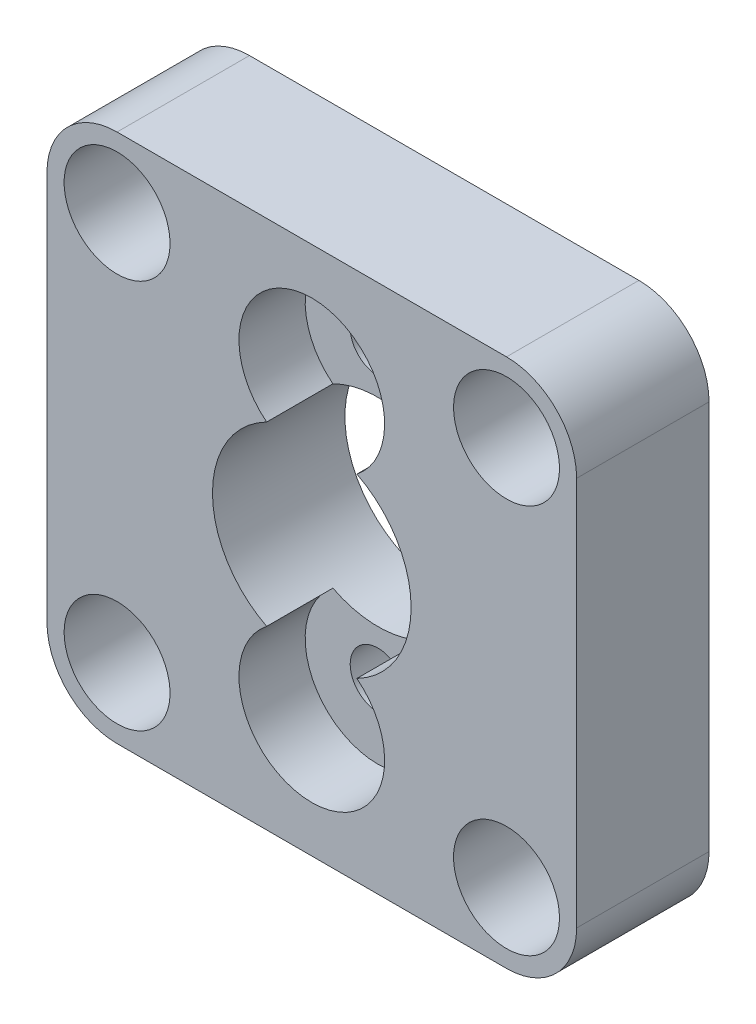
ISO-10303-21;
HEADER;
FILE_DESCRIPTION(('STEP AP214'),'2;1');
FILE_NAME('part.step','',(''),(''),'','','');
FILE_SCHEMA(('AUTOMOTIVE_DESIGN { 1 0 10303 214 1 1 1 1 }'));
ENDSEC;
DATA;
#1=APPLICATION_CONTEXT('core data for automotive mechanical design processes');
#2=APPLICATION_PROTOCOL_DEFINITION('international standard','automotive_design',2000,#1);
#3=PRODUCT_CONTEXT('',#1,'mechanical');
#4=PRODUCT('Part','Part','',(#3));
#5=PRODUCT_RELATED_PRODUCT_CATEGORY('part','',(#4));
#6=PRODUCT_DEFINITION_FORMATION('','',#4);
#7=PRODUCT_DEFINITION_CONTEXT('part definition',#1,'design');
#8=PRODUCT_DEFINITION('design','',#6,#7);
#9=PRODUCT_DEFINITION_SHAPE('','',#8);
#10=(LENGTH_UNIT() NAMED_UNIT(*) SI_UNIT(.MILLI.,.METRE.));
#11=(NAMED_UNIT(*) PLANE_ANGLE_UNIT() SI_UNIT($,.RADIAN.));
#12=(NAMED_UNIT(*) SI_UNIT($,.STERADIAN.) SOLID_ANGLE_UNIT());
#13=UNCERTAINTY_MEASURE_WITH_UNIT(LENGTH_MEASURE(1.E-05),#10,'distance_accuracy_value','');
#14=(GEOMETRIC_REPRESENTATION_CONTEXT(3) GLOBAL_UNCERTAINTY_ASSIGNED_CONTEXT((#13)) GLOBAL_UNIT_ASSIGNED_CONTEXT((#10,
#11,#12)) REPRESENTATION_CONTEXT('',''));
#15=CARTESIAN_POINT('',(0.,0.,0.));
#16=DIRECTION('',(0.,0.,1.));
#17=DIRECTION('',(1.,0.,0.));
#18=AXIS2_PLACEMENT_3D('',#15,#16,#17);
#19=CARTESIAN_POINT('',(-7.35229073212245,7.35229073212245,0.));
#20=DIRECTION('',(0.,0.,1.));
#21=DIRECTION('',(1.,0.,0.));
#22=AXIS2_PLACEMENT_3D('',#19,#20,#21);
#23=CYLINDRICAL_SURFACE('',#22,1.15);
#24=CARTESIAN_POINT('',(-7.35229073212245,7.35229073212245,0.));
#25=DIRECTION('',(0.,0.,1.));
#26=DIRECTION('',(1.,0.,0.));
#27=AXIS2_PLACEMENT_3D('',#24,#25,#26);
#28=CIRCLE('',#27,1.15);
#29=CARTESIAN_POINT('',(-6.20229073212244,7.35229073212245,0.));
#30=VERTEX_POINT('',#29);
#31=EDGE_CURVE('E222',#30,#30,#28,.T.);
#32=ORIENTED_EDGE('',*,*,#31,.F.);
#33=EDGE_LOOP('',(#32));
#34=FACE_BOUND('',#33,.T.);
#35=CARTESIAN_POINT('',(-7.35229073212245,7.35229073212245,2.));
#36=DIRECTION('',(0.,0.,1.));
#37=DIRECTION('',(1.,0.,0.));
#38=AXIS2_PLACEMENT_3D('',#35,#36,#37);
#39=CIRCLE('',#38,1.15);
#40=CARTESIAN_POINT('',(-6.20229073212244,7.35229073212245,2.));
#41=VERTEX_POINT('',#40);
#42=EDGE_CURVE('E207',#41,#41,#39,.F.);
#43=ORIENTED_EDGE('',*,*,#42,.F.);
#44=EDGE_LOOP('',(#43));
#45=FACE_BOUND('',#44,.T.);
#46=ADVANCED_FACE('F39',(#34,#45),#23,.F.);
#47=CARTESIAN_POINT('',(7.35229073212245,-7.35229073212245,0.));
#48=DIRECTION('',(0.,0.,1.));
#49=DIRECTION('',(1.,0.,0.));
#50=AXIS2_PLACEMENT_3D('',#47,#48,#49);
#51=CYLINDRICAL_SURFACE('',#50,1.15);
#52=CARTESIAN_POINT('',(7.35229073212245,-7.35229073212245,0.));
#53=DIRECTION('',(0.,0.,1.));
#54=DIRECTION('',(1.,0.,0.));
#55=AXIS2_PLACEMENT_3D('',#52,#53,#54);
#56=CIRCLE('',#55,1.15);
#57=CARTESIAN_POINT('',(8.50229073212244,-7.35229073212245,0.));
#58=VERTEX_POINT('',#57);
#59=EDGE_CURVE('E213',#58,#58,#56,.T.);
#60=ORIENTED_EDGE('',*,*,#59,.F.);
#61=EDGE_LOOP('',(#60));
#62=FACE_BOUND('',#61,.T.);
#63=CARTESIAN_POINT('',(7.35229073212245,-7.35229073212245,2.));
#64=DIRECTION('',(0.,0.,1.));
#65=DIRECTION('',(1.,0.,0.));
#66=AXIS2_PLACEMENT_3D('',#63,#64,#65);
#67=CIRCLE('',#66,1.15);
#68=CARTESIAN_POINT('',(8.50229073212244,-7.35229073212245,2.));
#69=VERTEX_POINT('',#68);
#70=EDGE_CURVE('E201',#69,#69,#67,.F.);
#71=ORIENTED_EDGE('',*,*,#70,.F.);
#72=EDGE_LOOP('',(#71));
#73=FACE_BOUND('',#72,.T.);
#74=ADVANCED_FACE('F304',(#62,#73),#51,.F.);
#75=CARTESIAN_POINT('',(0.,7.5,0.));
#76=DIRECTION('',(0.,0.,1.));
#77=DIRECTION('',(1.,0.,0.));
#78=AXIS2_PLACEMENT_3D('',#75,#76,#77);
#79=PLANE('',#78);
#80=CARTESIAN_POINT('',(-7.35229073212245,-7.35229073212245,0.));
#81=DIRECTION('',(0.,0.,1.));
#82=DIRECTION('',(-1.,0.,0.));
#83=AXIS2_PLACEMENT_3D('',#80,#81,#82);
#84=CIRCLE('',#83,1.15);
#85=CARTESIAN_POINT('',(-8.50229073212244,-7.35229073212245,0.));
#86=VERTEX_POINT('',#85);
#87=EDGE_CURVE('E209',#86,#86,#84,.T.);
#88=ORIENTED_EDGE('',*,*,#87,.T.);
#89=EDGE_LOOP('',(#88));
#90=FACE_BOUND('',#89,.T.);
#91=ORIENTED_EDGE('',*,*,#59,.T.);
#92=EDGE_LOOP('',(#91));
#93=FACE_BOUND('',#92,.T.);
#94=CARTESIAN_POINT('',(7.35229073212245,7.35229073212245,0.));
#95=DIRECTION('',(0.,0.,1.));
#96=DIRECTION('',(-1.,0.,0.));
#97=AXIS2_PLACEMENT_3D('',#94,#95,#96);
#98=CIRCLE('',#97,1.15);
#99=CARTESIAN_POINT('',(6.20229073212244,7.35229073212245,0.));
#100=VERTEX_POINT('',#99);
#101=EDGE_CURVE('E218',#100,#100,#98,.T.);
#102=ORIENTED_EDGE('',*,*,#101,.T.);
#103=EDGE_LOOP('',(#102));
#104=FACE_BOUND('',#103,.T.);
#105=ORIENTED_EDGE('',*,*,#31,.T.);
#106=EDGE_LOOP('',(#105));
#107=FACE_BOUND('',#106,.T.);
#108=CARTESIAN_POINT('',(0.,5.5,0.));
#109=DIRECTION('',(0.,0.,1.));
#110=DIRECTION('',(1.,0.,0.));
#111=AXIS2_PLACEMENT_3D('',#108,#109,#110);
#112=CIRCLE('',#111,1.05);
#113=CARTESIAN_POINT('',(1.05,5.5,0.));
#114=VERTEX_POINT('',#113);
#115=EDGE_CURVE('E161',#114,#114,#112,.T.);
#116=ORIENTED_EDGE('',*,*,#115,.T.);
#117=EDGE_LOOP('',(#116));
#118=FACE_BOUND('',#117,.T.);
#119=CARTESIAN_POINT('',(0.,-5.5,0.));
#120=DIRECTION('',(0.,0.,1.));
#121=DIRECTION('',(-1.,0.,0.));
#122=AXIS2_PLACEMENT_3D('',#119,#120,#121);
#123=CIRCLE('',#122,1.05);
#124=CARTESIAN_POINT('',(-1.05,-5.5,0.));
#125=VERTEX_POINT('',#124);
#126=EDGE_CURVE('E165',#125,#125,#123,.T.);
#127=ORIENTED_EDGE('',*,*,#126,.T.);
#128=EDGE_LOOP('',(#127));
#129=FACE_BOUND('',#128,.T.);
#130=CARTESIAN_POINT('',(0.,0.,0.));
#131=DIRECTION('',(0.,0.,1.));
#132=DIRECTION('',(1.,0.,0.));
#133=AXIS2_PLACEMENT_3D('',#130,#131,#132);
#134=CIRCLE('',#133,3.75);
#135=CARTESIAN_POINT('',(3.75,0.,0.));
#136=VERTEX_POINT('',#135);
#137=EDGE_CURVE('E47',#136,#136,#134,.T.);
#138=ORIENTED_EDGE('',*,*,#137,.T.);
#139=EDGE_LOOP('',(#138));
#140=FACE_BOUND('',#139,.T.);
#141=DIRECTION('',(1.,0.,0.));
#142=VECTOR('',#141,1.);
#143=CARTESIAN_POINT('',(10.,-10.,0.));
#144=LINE('',#143,#142);
#145=CARTESIAN_POINT('',(-7.35229073212245,-10.,0.));
#146=VERTEX_POINT('',#145);
#147=CARTESIAN_POINT('',(7.35229073212244,-10.,0.));
#148=VERTEX_POINT('',#147);
#149=EDGE_CURVE('E172',#146,#148,#144,.T.);
#150=ORIENTED_EDGE('',*,*,#149,.F.);
#151=CARTESIAN_POINT('',(-7.35229073212245,-7.35229073212245,0.));
#152=DIRECTION('',(0.,0.,-1.));
#153=DIRECTION('',(1.,0.,0.));
#154=AXIS2_PLACEMENT_3D('',#151,#152,#153);
#155=CIRCLE('',#154,2.64770926787756);
#156=CARTESIAN_POINT('',(-10.,-7.35229073212245,0.));
#157=VERTEX_POINT('',#156);
#158=EDGE_CURVE('E249',#146,#157,#155,.T.);
#159=ORIENTED_EDGE('',*,*,#158,.T.);
#160=DIRECTION('',(0.,-1.,0.));
#161=VECTOR('',#160,1.);
#162=CARTESIAN_POINT('',(-10.,-10.,0.));
#163=LINE('',#162,#161);
#164=CARTESIAN_POINT('',(-10.,7.35229073212245,0.));
#165=VERTEX_POINT('',#164);
#166=EDGE_CURVE('E169',#165,#157,#163,.T.);
#167=ORIENTED_EDGE('',*,*,#166,.F.);
#168=CARTESIAN_POINT('',(-7.35229073212245,7.35229073212245,0.));
#169=DIRECTION('',(0.,0.,-1.));
#170=DIRECTION('',(-1.,0.,0.));
#171=AXIS2_PLACEMENT_3D('',#168,#169,#170);
#172=CIRCLE('',#171,2.64770926787756);
#173=CARTESIAN_POINT('',(-7.35229073212245,10.,0.));
#174=VERTEX_POINT('',#173);
#175=EDGE_CURVE('E255',#165,#174,#172,.T.);
#176=ORIENTED_EDGE('',*,*,#175,.T.);
#177=DIRECTION('',(-1.,0.,0.));
#178=VECTOR('',#177,1.);
#179=CARTESIAN_POINT('',(10.,10.,0.));
#180=LINE('',#179,#178);
#181=CARTESIAN_POINT('',(7.35229073212244,10.,0.));
#182=VERTEX_POINT('',#181);
#183=EDGE_CURVE('E179',#182,#174,#180,.T.);
#184=ORIENTED_EDGE('',*,*,#183,.F.);
#185=CARTESIAN_POINT('',(7.35229073212244,7.35229073212245,0.));
#186=DIRECTION('',(0.,0.,-1.));
#187=DIRECTION('',(1.,0.,0.));
#188=AXIS2_PLACEMENT_3D('',#185,#186,#187);
#189=CIRCLE('',#188,2.64770926787756);
#190=CARTESIAN_POINT('',(10.,7.35229073212245,0.));
#191=VERTEX_POINT('',#190);
#192=EDGE_CURVE('E228',#182,#191,#189,.T.);
#193=ORIENTED_EDGE('',*,*,#192,.T.);
#194=DIRECTION('',(0.,1.,0.));
#195=VECTOR('',#194,1.);
#196=CARTESIAN_POINT('',(10.,-10.,0.));
#197=LINE('',#196,#195);
#198=CARTESIAN_POINT('',(10.,-7.35229073212245,0.));
#199=VERTEX_POINT('',#198);
#200=EDGE_CURVE('E176',#199,#191,#197,.T.);
#201=ORIENTED_EDGE('',*,*,#200,.F.);
#202=CARTESIAN_POINT('',(7.35229073212244,-7.35229073212245,0.));
#203=DIRECTION('',(0.,0.,-1.));
#204=DIRECTION('',(-1.,0.,0.));
#205=AXIS2_PLACEMENT_3D('',#202,#203,#204);
#206=CIRCLE('',#205,2.64770926787756);
#207=EDGE_CURVE('E239',#199,#148,#206,.T.);
#208=ORIENTED_EDGE('',*,*,#207,.T.);
#209=EDGE_LOOP('',(#150,#159,#167,#176,#184,#193,#201,#208));
#210=FACE_BOUND('',#209,.T.);
#211=ADVANCED_FACE('F41',(#90,#93,#104,#107,#118,#129,#140,#210),#79,.F.);
#212=CARTESIAN_POINT('',(0.,2.,5.));
#213=DIRECTION('',(0.,0.,-1.));
#214=DIRECTION('',(-1.,0.,0.));
#215=AXIS2_PLACEMENT_3D('',#212,#213,#214);
#216=PLANE('',#215);
#217=CARTESIAN_POINT('',(-7.35229073212245,-7.35229073212244,5.));
#218=DIRECTION('',(0.,0.,1.));
#219=DIRECTION('',(-1.,0.,0.));
#220=AXIS2_PLACEMENT_3D('',#217,#218,#219);
#221=CIRCLE('',#220,2.);
#222=CARTESIAN_POINT('',(-9.35229073212245,-7.35229073212244,5.));
#223=VERTEX_POINT('',#222);
#224=EDGE_CURVE('E389',#223,#223,#221,.T.);
#225=ORIENTED_EDGE('',*,*,#224,.F.);
#226=EDGE_LOOP('',(#225));
#227=FACE_BOUND('',#226,.T.);
#228=CARTESIAN_POINT('',(7.35229073212243,-7.35229073212246,5.));
#229=DIRECTION('',(0.,0.,1.));
#230=DIRECTION('',(1.,0.,0.));
#231=AXIS2_PLACEMENT_3D('',#228,#229,#230);
#232=CIRCLE('',#231,2.);
#233=CARTESIAN_POINT('',(9.35229073212243,-7.35229073212246,5.));
#234=VERTEX_POINT('',#233);
#235=EDGE_CURVE('E395',#234,#234,#232,.T.);
#236=ORIENTED_EDGE('',*,*,#235,.F.);
#237=EDGE_LOOP('',(#236));
#238=FACE_BOUND('',#237,.T.);
#239=CARTESIAN_POINT('',(7.35229073212243,7.35229073212246,5.));
#240=DIRECTION('',(0.,0.,1.));
#241=DIRECTION('',(-1.,0.,0.));
#242=AXIS2_PLACEMENT_3D('',#239,#240,#241);
#243=CIRCLE('',#242,2.);
#244=CARTESIAN_POINT('',(5.35229073212243,7.35229073212246,5.));
#245=VERTEX_POINT('',#244);
#246=EDGE_CURVE('E383',#245,#245,#243,.T.);
#247=ORIENTED_EDGE('',*,*,#246,.F.);
#248=EDGE_LOOP('',(#247));
#249=FACE_BOUND('',#248,.T.);
#250=CARTESIAN_POINT('',(-7.35229073212245,7.35229073212245,5.));
#251=DIRECTION('',(0.,0.,1.));
#252=DIRECTION('',(1.,0.,0.));
#253=AXIS2_PLACEMENT_3D('',#250,#251,#252);
#254=CIRCLE('',#253,2.);
#255=CARTESIAN_POINT('',(-5.35229073212245,7.35229073212245,5.));
#256=VERTEX_POINT('',#255);
#257=EDGE_CURVE('E380',#256,#256,#254,.T.);
#258=ORIENTED_EDGE('',*,*,#257,.F.);
#259=EDGE_LOOP('',(#258));
#260=FACE_BOUND('',#259,.T.);
#261=CARTESIAN_POINT('',(0.,5.5,5.));
#262=DIRECTION('',(0.,0.,1.));
#263=DIRECTION('',(1.,0.,0.));
#264=AXIS2_PLACEMENT_3D('',#261,#262,#263);
#265=CIRCLE('',#264,2.75);
#266=CARTESIAN_POINT('',(1.70318127229047,3.34090909090909,5.));
#267=VERTEX_POINT('',#266);
#268=CARTESIAN_POINT('',(-1.70318127229047,3.34090909090909,5.));
#269=VERTEX_POINT('',#268);
#270=EDGE_CURVE('E143',#267,#269,#265,.T.);
#271=ORIENTED_EDGE('',*,*,#270,.F.);
#272=CARTESIAN_POINT('',(0.,0.,5.));
#273=DIRECTION('',(0.,0.,-1.));
#274=DIRECTION('',(-1.,0.,0.));
#275=AXIS2_PLACEMENT_3D('',#272,#273,#274);
#276=CIRCLE('',#275,3.75);
#277=CARTESIAN_POINT('',(1.70318127229047,-3.34090909090909,5.));
#278=VERTEX_POINT('',#277);
#279=EDGE_CURVE('E146',#267,#278,#276,.T.);
#280=ORIENTED_EDGE('',*,*,#279,.T.);
#281=CARTESIAN_POINT('',(0.,-5.5,5.));
#282=DIRECTION('',(0.,0.,1.));
#283=DIRECTION('',(-1.,0.,0.));
#284=AXIS2_PLACEMENT_3D('',#281,#282,#283);
#285=CIRCLE('',#284,2.75);
#286=CARTESIAN_POINT('',(-1.70318127229047,-3.34090909090909,5.));
#287=VERTEX_POINT('',#286);
#288=EDGE_CURVE('E145',#287,#278,#285,.T.);
#289=ORIENTED_EDGE('',*,*,#288,.F.);
#290=EDGE_CURVE('E128',#287,#269,#276,.T.);
#291=ORIENTED_EDGE('',*,*,#290,.T.);
#292=EDGE_LOOP('',(#271,#280,#289,#291));
#293=FACE_BOUND('',#292,.T.);
#294=DIRECTION('',(0.,-1.,0.));
#295=VECTOR('',#294,1.);
#296=CARTESIAN_POINT('',(-10.,-10.,5.));
#297=LINE('',#296,#295);
#298=CARTESIAN_POINT('',(-10.,7.35229073212245,5.));
#299=VERTEX_POINT('',#298);
#300=CARTESIAN_POINT('',(-10.,-7.35229073212245,5.));
#301=VERTEX_POINT('',#300);
#302=EDGE_CURVE('E164',#299,#301,#297,.T.);
#303=ORIENTED_EDGE('',*,*,#302,.T.);
#304=CARTESIAN_POINT('',(-7.35229073212245,-7.35229073212245,5.));
#305=DIRECTION('',(0.,0.,-1.));
#306=DIRECTION('',(1.,0.,0.));
#307=AXIS2_PLACEMENT_3D('',#304,#305,#306);
#308=CIRCLE('',#307,2.64770926787756);
#309=CARTESIAN_POINT('',(-7.35229073212245,-10.,5.));
#310=VERTEX_POINT('',#309);
#311=EDGE_CURVE('E243',#310,#301,#308,.T.);
#312=ORIENTED_EDGE('',*,*,#311,.F.);
#313=DIRECTION('',(1.,0.,0.));
#314=VECTOR('',#313,1.);
#315=CARTESIAN_POINT('',(10.,-10.,5.));
#316=LINE('',#315,#314);
#317=CARTESIAN_POINT('',(7.35229073212244,-10.,5.));
#318=VERTEX_POINT('',#317);
#319=EDGE_CURVE('E184',#310,#318,#316,.T.);
#320=ORIENTED_EDGE('',*,*,#319,.T.);
#321=CARTESIAN_POINT('',(7.35229073212244,-7.35229073212245,5.));
#322=DIRECTION('',(0.,0.,-1.));
#323=DIRECTION('',(-1.,0.,0.));
#324=AXIS2_PLACEMENT_3D('',#321,#322,#323);
#325=CIRCLE('',#324,2.64770926787756);
#326=CARTESIAN_POINT('',(10.,-7.35229073212245,5.));
#327=VERTEX_POINT('',#326);
#328=EDGE_CURVE('E232',#327,#318,#325,.T.);
#329=ORIENTED_EDGE('',*,*,#328,.F.);
#330=DIRECTION('',(0.,1.,0.));
#331=VECTOR('',#330,1.);
#332=CARTESIAN_POINT('',(10.,-10.,5.));
#333=LINE('',#332,#331);
#334=CARTESIAN_POINT('',(10.,7.35229073212245,5.));
#335=VERTEX_POINT('',#334);
#336=EDGE_CURVE('E187',#327,#335,#333,.T.);
#337=ORIENTED_EDGE('',*,*,#336,.T.);
#338=CARTESIAN_POINT('',(7.35229073212244,7.35229073212245,5.));
#339=DIRECTION('',(0.,0.,-1.));
#340=DIRECTION('',(1.,0.,0.));
#341=AXIS2_PLACEMENT_3D('',#338,#339,#340);
#342=CIRCLE('',#341,2.64770926787756);
#343=CARTESIAN_POINT('',(7.35229073212244,10.,5.));
#344=VERTEX_POINT('',#343);
#345=EDGE_CURVE('E233',#344,#335,#342,.T.);
#346=ORIENTED_EDGE('',*,*,#345,.F.);
#347=DIRECTION('',(-1.,0.,0.));
#348=VECTOR('',#347,1.);
#349=CARTESIAN_POINT('',(10.,10.,5.));
#350=LINE('',#349,#348);
#351=CARTESIAN_POINT('',(-7.35229073212245,10.,5.));
#352=VERTEX_POINT('',#351);
#353=EDGE_CURVE('E173',#344,#352,#350,.T.);
#354=ORIENTED_EDGE('',*,*,#353,.T.);
#355=CARTESIAN_POINT('',(-7.35229073212245,7.35229073212245,5.));
#356=DIRECTION('',(0.,0.,-1.));
#357=DIRECTION('',(-1.,0.,0.));
#358=AXIS2_PLACEMENT_3D('',#355,#356,#357);
#359=CIRCLE('',#358,2.64770926787756);
#360=EDGE_CURVE('E61',#299,#352,#359,.T.);
#361=ORIENTED_EDGE('',*,*,#360,.F.);
#362=EDGE_LOOP('',(#303,#312,#320,#329,#337,#346,#354,#361));
#363=FACE_BOUND('',#362,.T.);
#364=ADVANCED_FACE('F140',(#227,#238,#249,#260,#293,#363),#216,.F.);
#365=CARTESIAN_POINT('',(0.,5.5,0.));
#366=DIRECTION('',(0.,0.,1.));
#367=DIRECTION('',(1.,0.,0.));
#368=AXIS2_PLACEMENT_3D('',#365,#366,#367);
#369=CYLINDRICAL_SURFACE('',#368,1.05);
#370=ORIENTED_EDGE('',*,*,#115,.F.);
#371=EDGE_LOOP('',(#370));
#372=FACE_BOUND('',#371,.T.);
#373=CARTESIAN_POINT('',(0.,5.5,2.5));
#374=DIRECTION('',(0.,0.,1.));
#375=DIRECTION('',(1.,0.,0.));
#376=AXIS2_PLACEMENT_3D('',#373,#374,#375);
#377=CIRCLE('',#376,1.05);
#378=CARTESIAN_POINT('',(1.05,5.5,2.5));
#379=VERTEX_POINT('',#378);
#380=EDGE_CURVE('E152',#379,#379,#377,.F.);
#381=ORIENTED_EDGE('',*,*,#380,.F.);
#382=EDGE_LOOP('',(#381));
#383=FACE_BOUND('',#382,.T.);
#384=ADVANCED_FACE('F338',(#372,#383),#369,.F.);
#385=CARTESIAN_POINT('',(0.,0.,12.6));
#386=DIRECTION('',(0.,0.,1.));
#387=DIRECTION('',(1.,0.,0.));
#388=AXIS2_PLACEMENT_3D('',#385,#386,#387);
#389=CYLINDRICAL_SURFACE('',#388,3.75);
#390=ORIENTED_EDGE('',*,*,#137,.F.);
#391=EDGE_LOOP('',(#390));
#392=FACE_BOUND('',#391,.T.);
#393=CARTESIAN_POINT('',(0.,0.,2.5));
#394=DIRECTION('',(0.,0.,1.));
#395=DIRECTION('',(1.,0.,0.));
#396=AXIS2_PLACEMENT_3D('',#393,#394,#395);
#397=CIRCLE('',#396,3.75);
#398=CARTESIAN_POINT('',(1.70318127229047,3.34090909090909,2.5));
#399=VERTEX_POINT('',#398);
#400=CARTESIAN_POINT('',(-1.70318127229047,3.34090909090909,2.5));
#401=VERTEX_POINT('',#400);
#402=EDGE_CURVE('E130',#399,#401,#397,.T.);
#403=ORIENTED_EDGE('',*,*,#402,.T.);
#404=DIRECTION('',(0.,0.,-1.));
#405=VECTOR('',#404,1.);
#406=CARTESIAN_POINT('',(-1.70318127229047,3.34090909090909,2.5));
#407=LINE('',#406,#405);
#408=EDGE_CURVE('E125',#269,#401,#407,.T.);
#409=ORIENTED_EDGE('',*,*,#408,.F.);
#410=ORIENTED_EDGE('',*,*,#290,.F.);
#411=DIRECTION('',(0.,0.,-1.));
#412=VECTOR('',#411,1.);
#413=CARTESIAN_POINT('',(-1.70318127229047,-3.34090909090909,2.5));
#414=LINE('',#413,#412);
#415=CARTESIAN_POINT('',(-1.70318127229047,-3.34090909090909,2.5));
#416=VERTEX_POINT('',#415);
#417=EDGE_CURVE('E54',#416,#287,#414,.F.);
#418=ORIENTED_EDGE('',*,*,#417,.F.);
#419=CARTESIAN_POINT('',(0.,0.,2.5));
#420=DIRECTION('',(0.,0.,-1.));
#421=DIRECTION('',(-1.,0.,0.));
#422=AXIS2_PLACEMENT_3D('',#419,#420,#421);
#423=CIRCLE('',#422,3.75);
#424=CARTESIAN_POINT('',(1.70318127229047,-3.34090909090909,2.5));
#425=VERTEX_POINT('',#424);
#426=EDGE_CURVE('E11',#425,#416,#423,.T.);
#427=ORIENTED_EDGE('',*,*,#426,.F.);
#428=DIRECTION('',(0.,0.,-1.));
#429=VECTOR('',#428,1.);
#430=CARTESIAN_POINT('',(1.70318127229047,-3.34090909090909,2.5));
#431=LINE('',#430,#429);
#432=EDGE_CURVE('E406',#278,#425,#431,.T.);
#433=ORIENTED_EDGE('',*,*,#432,.F.);
#434=ORIENTED_EDGE('',*,*,#279,.F.);
#435=DIRECTION('',(0.,0.,-1.));
#436=VECTOR('',#435,1.);
#437=CARTESIAN_POINT('',(1.70318127229047,3.34090909090909,2.5));
#438=LINE('',#437,#436);
#439=EDGE_CURVE('E135',#399,#267,#438,.F.);
#440=ORIENTED_EDGE('',*,*,#439,.F.);
#441=EDGE_LOOP('',(#403,#409,#410,#418,#427,#433,#434,#440));
#442=FACE_BOUND('',#441,.T.);
#443=ADVANCED_FACE('F127',(#392,#442),#389,.F.);
#444=CARTESIAN_POINT('',(-10.,-10.,0.));
#445=DIRECTION('',(-1.,0.,0.));
#446=DIRECTION('',(0.,0.,1.));
#447=AXIS2_PLACEMENT_3D('',#444,#445,#446);
#448=PLANE('',#447);
#449=DIRECTION('',(0.,0.,1.));
#450=VECTOR('',#449,1.);
#451=CARTESIAN_POINT('',(-10.,-7.35229073212245,0.));
#452=LINE('',#451,#450);
#453=EDGE_CURVE('E225',#157,#301,#452,.T.);
#454=ORIENTED_EDGE('',*,*,#453,.T.);
#455=ORIENTED_EDGE('',*,*,#302,.F.);
#456=DIRECTION('',(0.,0.,1.));
#457=VECTOR('',#456,1.);
#458=CARTESIAN_POINT('',(-10.,7.35229073212245,0.));
#459=LINE('',#458,#457);
#460=EDGE_CURVE('E160',#165,#299,#459,.T.);
#461=ORIENTED_EDGE('',*,*,#460,.F.);
#462=ORIENTED_EDGE('',*,*,#166,.T.);
#463=EDGE_LOOP('',(#454,#455,#461,#462));
#464=FACE_BOUND('',#463,.T.);
#465=ADVANCED_FACE('F281',(#464),#448,.T.);
#466=CARTESIAN_POINT('',(10.,10.,0.));
#467=DIRECTION('',(0.,1.,0.));
#468=DIRECTION('',(0.,0.,1.));
#469=AXIS2_PLACEMENT_3D('',#466,#467,#468);
#470=PLANE('',#469);
#471=DIRECTION('',(0.,0.,1.));
#472=VECTOR('',#471,1.);
#473=CARTESIAN_POINT('',(7.35229073212244,10.,0.));
#474=LINE('',#473,#472);
#475=EDGE_CURVE('E226',#182,#344,#474,.T.);
#476=ORIENTED_EDGE('',*,*,#475,.F.);
#477=ORIENTED_EDGE('',*,*,#183,.T.);
#478=DIRECTION('',(0.,0.,1.));
#479=VECTOR('',#478,1.);
#480=CARTESIAN_POINT('',(-7.35229073212245,10.,0.));
#481=LINE('',#480,#479);
#482=EDGE_CURVE('E258',#174,#352,#481,.T.);
#483=ORIENTED_EDGE('',*,*,#482,.T.);
#484=ORIENTED_EDGE('',*,*,#353,.F.);
#485=EDGE_LOOP('',(#476,#477,#483,#484));
#486=FACE_BOUND('',#485,.T.);
#487=ADVANCED_FACE('F263',(#486),#470,.T.);
#488=CARTESIAN_POINT('',(10.,-10.,0.));
#489=DIRECTION('',(1.,0.,0.));
#490=DIRECTION('',(0.,0.,-1.));
#491=AXIS2_PLACEMENT_3D('',#488,#489,#490);
#492=PLANE('',#491);
#493=DIRECTION('',(0.,0.,1.));
#494=VECTOR('',#493,1.);
#495=CARTESIAN_POINT('',(10.,-7.35229073212245,0.));
#496=LINE('',#495,#494);
#497=EDGE_CURVE('E237',#199,#327,#496,.T.);
#498=ORIENTED_EDGE('',*,*,#497,.F.);
#499=ORIENTED_EDGE('',*,*,#200,.T.);
#500=DIRECTION('',(0.,0.,1.));
#501=VECTOR('',#500,1.);
#502=CARTESIAN_POINT('',(10.,7.35229073212245,0.));
#503=LINE('',#502,#501);
#504=EDGE_CURVE('E229',#191,#335,#503,.T.);
#505=ORIENTED_EDGE('',*,*,#504,.T.);
#506=ORIENTED_EDGE('',*,*,#336,.F.);
#507=EDGE_LOOP('',(#498,#499,#505,#506));
#508=FACE_BOUND('',#507,.T.);
#509=ADVANCED_FACE('F273',(#508),#492,.T.);
#510=CARTESIAN_POINT('',(10.,-10.,0.));
#511=DIRECTION('',(0.,-1.,0.));
#512=DIRECTION('',(0.,0.,-1.));
#513=AXIS2_PLACEMENT_3D('',#510,#511,#512);
#514=PLANE('',#513);
#515=DIRECTION('',(0.,0.,1.));
#516=VECTOR('',#515,1.);
#517=CARTESIAN_POINT('',(-7.35229073212245,-10.,0.));
#518=LINE('',#517,#516);
#519=EDGE_CURVE('E247',#146,#310,#518,.T.);
#520=ORIENTED_EDGE('',*,*,#519,.F.);
#521=ORIENTED_EDGE('',*,*,#149,.T.);
#522=DIRECTION('',(0.,0.,1.));
#523=VECTOR('',#522,1.);
#524=CARTESIAN_POINT('',(7.35229073212244,-10.,0.));
#525=LINE('',#524,#523);
#526=EDGE_CURVE('E240',#148,#318,#525,.T.);
#527=ORIENTED_EDGE('',*,*,#526,.T.);
#528=ORIENTED_EDGE('',*,*,#319,.F.);
#529=EDGE_LOOP('',(#520,#521,#527,#528));
#530=FACE_BOUND('',#529,.T.);
#531=ADVANCED_FACE('F287',(#530),#514,.T.);
#532=CARTESIAN_POINT('',(0.,-5.5,0.));
#533=DIRECTION('',(0.,0.,1.));
#534=DIRECTION('',(1.,0.,0.));
#535=AXIS2_PLACEMENT_3D('',#532,#533,#534);
#536=CYLINDRICAL_SURFACE('',#535,1.05);
#537=CARTESIAN_POINT('',(0.,-5.5,2.5));
#538=DIRECTION('',(0.,0.,-1.));
#539=DIRECTION('',(-1.,0.,0.));
#540=AXIS2_PLACEMENT_3D('',#537,#538,#539);
#541=CIRCLE('',#540,1.05);
#542=CARTESIAN_POINT('',(-1.05,-5.5,2.5));
#543=VERTEX_POINT('',#542);
#544=EDGE_CURVE('E168',#543,#543,#541,.F.);
#545=ORIENTED_EDGE('',*,*,#544,.T.);
#546=EDGE_LOOP('',(#545));
#547=FACE_BOUND('',#546,.T.);
#548=ORIENTED_EDGE('',*,*,#126,.F.);
#549=EDGE_LOOP('',(#548));
#550=FACE_BOUND('',#549,.T.);
#551=ADVANCED_FACE('F334',(#547,#550),#536,.F.);
#552=CARTESIAN_POINT('',(0.,5.5,2.5));
#553=DIRECTION('',(0.,0.,1.));
#554=DIRECTION('',(1.,0.,0.));
#555=AXIS2_PLACEMENT_3D('',#552,#553,#554);
#556=CYLINDRICAL_SURFACE('',#555,2.75);
#557=CARTESIAN_POINT('',(0.,5.5,2.5));
#558=DIRECTION('',(0.,0.,1.));
#559=DIRECTION('',(1.,0.,0.));
#560=AXIS2_PLACEMENT_3D('',#557,#558,#559);
#561=CIRCLE('',#560,2.75);
#562=EDGE_CURVE('E150',#399,#401,#561,.T.);
#563=ORIENTED_EDGE('',*,*,#562,.F.);
#564=ORIENTED_EDGE('',*,*,#439,.T.);
#565=ORIENTED_EDGE('',*,*,#270,.T.);
#566=ORIENTED_EDGE('',*,*,#408,.T.);
#567=EDGE_LOOP('',(#563,#564,#565,#566));
#568=FACE_BOUND('',#567,.T.);
#569=ADVANCED_FACE('F149',(#568),#556,.F.);
#570=CARTESIAN_POINT('',(0.,5.5,2.5));
#571=DIRECTION('',(0.,0.,1.));
#572=DIRECTION('',(1.,0.,0.));
#573=AXIS2_PLACEMENT_3D('',#570,#571,#572);
#574=PLANE('',#573);
#575=ORIENTED_EDGE('',*,*,#402,.F.);
#576=ORIENTED_EDGE('',*,*,#562,.T.);
#577=EDGE_LOOP('',(#575,#576));
#578=FACE_BOUND('',#577,.T.);
#579=ORIENTED_EDGE('',*,*,#380,.T.);
#580=EDGE_LOOP('',(#579));
#581=FACE_BOUND('',#580,.T.);
#582=ADVANCED_FACE('F328',(#578,#581),#574,.T.);
#583=CARTESIAN_POINT('',(0.,-5.5,2.5));
#584=DIRECTION('',(0.,0.,1.));
#585=DIRECTION('',(1.,0.,0.));
#586=AXIS2_PLACEMENT_3D('',#583,#584,#585);
#587=CYLINDRICAL_SURFACE('',#586,2.75);
#588=CARTESIAN_POINT('',(0.,-5.5,2.5));
#589=DIRECTION('',(0.,0.,1.));
#590=DIRECTION('',(-1.,0.,0.));
#591=AXIS2_PLACEMENT_3D('',#588,#589,#590);
#592=CIRCLE('',#591,2.75);
#593=EDGE_CURVE('E154',#416,#425,#592,.T.);
#594=ORIENTED_EDGE('',*,*,#593,.F.);
#595=ORIENTED_EDGE('',*,*,#417,.T.);
#596=ORIENTED_EDGE('',*,*,#288,.T.);
#597=ORIENTED_EDGE('',*,*,#432,.T.);
#598=EDGE_LOOP('',(#594,#595,#596,#597));
#599=FACE_BOUND('',#598,.T.);
#600=ADVANCED_FACE('F299',(#599),#587,.F.);
#601=CARTESIAN_POINT('',(0.,-5.5,2.5));
#602=DIRECTION('',(0.,0.,-1.));
#603=DIRECTION('',(-1.,0.,0.));
#604=AXIS2_PLACEMENT_3D('',#601,#602,#603);
#605=PLANE('',#604);
#606=ORIENTED_EDGE('',*,*,#544,.F.);
#607=EDGE_LOOP('',(#606));
#608=FACE_BOUND('',#607,.T.);
#609=ORIENTED_EDGE('',*,*,#593,.T.);
#610=ORIENTED_EDGE('',*,*,#426,.T.);
#611=EDGE_LOOP('',(#609,#610));
#612=FACE_BOUND('',#611,.T.);
#613=ADVANCED_FACE('F292',(#608,#612),#605,.F.);
#614=CARTESIAN_POINT('',(7.35229073212244,-7.35229073212245,0.));
#615=DIRECTION('',(0.,0.,1.));
#616=DIRECTION('',(1.,0.,0.));
#617=AXIS2_PLACEMENT_3D('',#614,#615,#616);
#618=CYLINDRICAL_SURFACE('',#617,2.64770926787756);
#619=ORIENTED_EDGE('',*,*,#328,.T.);
#620=ORIENTED_EDGE('',*,*,#526,.F.);
#621=ORIENTED_EDGE('',*,*,#207,.F.);
#622=ORIENTED_EDGE('',*,*,#497,.T.);
#623=EDGE_LOOP('',(#619,#620,#621,#622));
#624=FACE_BOUND('',#623,.T.);
#625=ADVANCED_FACE('F289',(#624),#618,.T.);
#626=CARTESIAN_POINT('',(-7.35229073212245,-7.35229073212245,0.));
#627=DIRECTION('',(0.,0.,1.));
#628=DIRECTION('',(1.,0.,0.));
#629=AXIS2_PLACEMENT_3D('',#626,#627,#628);
#630=CYLINDRICAL_SURFACE('',#629,2.64770926787756);
#631=ORIENTED_EDGE('',*,*,#311,.T.);
#632=ORIENTED_EDGE('',*,*,#453,.F.);
#633=ORIENTED_EDGE('',*,*,#158,.F.);
#634=ORIENTED_EDGE('',*,*,#519,.T.);
#635=EDGE_LOOP('',(#631,#632,#633,#634));
#636=FACE_BOUND('',#635,.T.);
#637=ADVANCED_FACE('F291',(#636),#630,.T.);
#638=CARTESIAN_POINT('',(7.35229073212244,7.35229073212245,0.));
#639=DIRECTION('',(0.,0.,1.));
#640=DIRECTION('',(1.,0.,0.));
#641=AXIS2_PLACEMENT_3D('',#638,#639,#640);
#642=CYLINDRICAL_SURFACE('',#641,2.64770926787756);
#643=ORIENTED_EDGE('',*,*,#345,.T.);
#644=ORIENTED_EDGE('',*,*,#504,.F.);
#645=ORIENTED_EDGE('',*,*,#192,.F.);
#646=ORIENTED_EDGE('',*,*,#475,.T.);
#647=EDGE_LOOP('',(#643,#644,#645,#646));
#648=FACE_BOUND('',#647,.T.);
#649=ADVANCED_FACE('F270',(#648),#642,.T.);
#650=CARTESIAN_POINT('',(-7.35229073212245,7.35229073212245,0.));
#651=DIRECTION('',(0.,0.,1.));
#652=DIRECTION('',(1.,0.,0.));
#653=AXIS2_PLACEMENT_3D('',#650,#651,#652);
#654=CYLINDRICAL_SURFACE('',#653,2.64770926787756);
#655=ORIENTED_EDGE('',*,*,#360,.T.);
#656=ORIENTED_EDGE('',*,*,#482,.F.);
#657=ORIENTED_EDGE('',*,*,#175,.F.);
#658=ORIENTED_EDGE('',*,*,#460,.T.);
#659=EDGE_LOOP('',(#655,#656,#657,#658));
#660=FACE_BOUND('',#659,.T.);
#661=ADVANCED_FACE('F279',(#660),#654,.T.);
#662=CARTESIAN_POINT('',(7.35229073212245,7.35229073212245,0.));
#663=DIRECTION('',(0.,0.,1.));
#664=DIRECTION('',(1.,0.,0.));
#665=AXIS2_PLACEMENT_3D('',#662,#663,#664);
#666=CYLINDRICAL_SURFACE('',#665,1.15);
#667=CARTESIAN_POINT('',(7.35229073212245,7.35229073212245,2.));
#668=DIRECTION('',(0.,0.,-1.));
#669=DIRECTION('',(-1.,0.,0.));
#670=AXIS2_PLACEMENT_3D('',#667,#668,#669);
#671=CIRCLE('',#670,1.15);
#672=CARTESIAN_POINT('',(6.20229073212244,7.35229073212245,2.));
#673=VERTEX_POINT('',#672);
#674=EDGE_CURVE('E205',#673,#673,#671,.F.);
#675=ORIENTED_EDGE('',*,*,#674,.T.);
#676=EDGE_LOOP('',(#675));
#677=FACE_BOUND('',#676,.T.);
#678=ORIENTED_EDGE('',*,*,#101,.F.);
#679=EDGE_LOOP('',(#678));
#680=FACE_BOUND('',#679,.T.);
#681=ADVANCED_FACE('F320',(#677,#680),#666,.F.);
#682=CARTESIAN_POINT('',(-7.35229073212245,-7.35229073212245,0.));
#683=DIRECTION('',(0.,0.,1.));
#684=DIRECTION('',(1.,0.,0.));
#685=AXIS2_PLACEMENT_3D('',#682,#683,#684);
#686=CYLINDRICAL_SURFACE('',#685,1.15);
#687=CARTESIAN_POINT('',(-7.35229073212245,-7.35229073212245,2.));
#688=DIRECTION('',(0.,0.,-1.));
#689=DIRECTION('',(-1.,0.,0.));
#690=AXIS2_PLACEMENT_3D('',#687,#688,#689);
#691=CIRCLE('',#690,1.15);
#692=CARTESIAN_POINT('',(-8.50229073212244,-7.35229073212245,2.));
#693=VERTEX_POINT('',#692);
#694=EDGE_CURVE('E198',#693,#693,#691,.F.);
#695=ORIENTED_EDGE('',*,*,#694,.T.);
#696=EDGE_LOOP('',(#695));
#697=FACE_BOUND('',#696,.T.);
#698=ORIENTED_EDGE('',*,*,#87,.F.);
#699=EDGE_LOOP('',(#698));
#700=FACE_BOUND('',#699,.T.);
#701=ADVANCED_FACE('F315',(#697,#700),#686,.F.);
#702=CARTESIAN_POINT('',(-7.35229073212245,-7.35229073212244,2.));
#703=DIRECTION('',(0.,0.,-1.));
#704=DIRECTION('',(-1.,0.,0.));
#705=AXIS2_PLACEMENT_3D('',#702,#703,#704);
#706=PLANE('',#705);
#707=CARTESIAN_POINT('',(-7.35229073212245,-7.35229073212244,2.));
#708=DIRECTION('',(0.,0.,1.));
#709=DIRECTION('',(-1.,0.,0.));
#710=AXIS2_PLACEMENT_3D('',#707,#708,#709);
#711=CIRCLE('',#710,2.);
#712=CARTESIAN_POINT('',(-9.35229073212245,-7.35229073212244,2.));
#713=VERTEX_POINT('',#712);
#714=EDGE_CURVE('E386',#713,#713,#711,.T.);
#715=ORIENTED_EDGE('',*,*,#714,.T.);
#716=EDGE_LOOP('',(#715));
#717=FACE_BOUND('',#716,.T.);
#718=ORIENTED_EDGE('',*,*,#694,.F.);
#719=EDGE_LOOP('',(#718));
#720=FACE_BOUND('',#719,.T.);
#721=ADVANCED_FACE('F429',(#717,#720),#706,.F.);
#722=CARTESIAN_POINT('',(-7.35229073212245,-7.35229073212244,2.));
#723=DIRECTION('',(0.,0.,1.));
#724=DIRECTION('',(1.,0.,0.));
#725=AXIS2_PLACEMENT_3D('',#722,#723,#724);
#726=CYLINDRICAL_SURFACE('',#725,2.);
#727=ORIENTED_EDGE('',*,*,#714,.F.);
#728=EDGE_LOOP('',(#727));
#729=FACE_BOUND('',#728,.T.);
#730=ORIENTED_EDGE('',*,*,#224,.T.);
#731=EDGE_LOOP('',(#730));
#732=FACE_BOUND('',#731,.T.);
#733=ADVANCED_FACE('F432',(#729,#732),#726,.F.);
#734=CARTESIAN_POINT('',(7.35229073212243,-7.35229073212246,2.));
#735=DIRECTION('',(0.,0.,1.));
#736=DIRECTION('',(1.,0.,0.));
#737=AXIS2_PLACEMENT_3D('',#734,#735,#736);
#738=PLANE('',#737);
#739=CARTESIAN_POINT('',(7.35229073212243,-7.35229073212246,2.));
#740=DIRECTION('',(0.,0.,1.));
#741=DIRECTION('',(1.,0.,0.));
#742=AXIS2_PLACEMENT_3D('',#739,#740,#741);
#743=CIRCLE('',#742,2.);
#744=CARTESIAN_POINT('',(9.35229073212243,-7.35229073212246,2.));
#745=VERTEX_POINT('',#744);
#746=EDGE_CURVE('E392',#745,#745,#743,.T.);
#747=ORIENTED_EDGE('',*,*,#746,.T.);
#748=EDGE_LOOP('',(#747));
#749=FACE_BOUND('',#748,.T.);
#750=ORIENTED_EDGE('',*,*,#70,.T.);
#751=EDGE_LOOP('',(#750));
#752=FACE_BOUND('',#751,.T.);
#753=ADVANCED_FACE('F436',(#749,#752),#738,.T.);
#754=CARTESIAN_POINT('',(7.35229073212243,-7.35229073212246,2.));
#755=DIRECTION('',(0.,0.,1.));
#756=DIRECTION('',(1.,0.,0.));
#757=AXIS2_PLACEMENT_3D('',#754,#755,#756);
#758=CYLINDRICAL_SURFACE('',#757,2.);
#759=ORIENTED_EDGE('',*,*,#746,.F.);
#760=EDGE_LOOP('',(#759));
#761=FACE_BOUND('',#760,.T.);
#762=ORIENTED_EDGE('',*,*,#235,.T.);
#763=EDGE_LOOP('',(#762));
#764=FACE_BOUND('',#763,.T.);
#765=ADVANCED_FACE('F440',(#761,#764),#758,.F.);
#766=CARTESIAN_POINT('',(7.35229073212243,7.35229073212246,2.));
#767=DIRECTION('',(0.,0.,-1.));
#768=DIRECTION('',(-1.,0.,0.));
#769=AXIS2_PLACEMENT_3D('',#766,#767,#768);
#770=PLANE('',#769);
#771=CARTESIAN_POINT('',(7.35229073212243,7.35229073212246,2.));
#772=DIRECTION('',(0.,0.,1.));
#773=DIRECTION('',(-1.,0.,0.));
#774=AXIS2_PLACEMENT_3D('',#771,#772,#773);
#775=CIRCLE('',#774,2.);
#776=CARTESIAN_POINT('',(5.35229073212243,7.35229073212246,2.));
#777=VERTEX_POINT('',#776);
#778=EDGE_CURVE('E398',#777,#777,#775,.T.);
#779=ORIENTED_EDGE('',*,*,#778,.T.);
#780=EDGE_LOOP('',(#779));
#781=FACE_BOUND('',#780,.T.);
#782=ORIENTED_EDGE('',*,*,#674,.F.);
#783=EDGE_LOOP('',(#782));
#784=FACE_BOUND('',#783,.T.);
#785=ADVANCED_FACE('F444',(#781,#784),#770,.F.);
#786=CARTESIAN_POINT('',(7.35229073212243,7.35229073212246,2.));
#787=DIRECTION('',(0.,0.,1.));
#788=DIRECTION('',(1.,0.,0.));
#789=AXIS2_PLACEMENT_3D('',#786,#787,#788);
#790=CYLINDRICAL_SURFACE('',#789,2.);
#791=ORIENTED_EDGE('',*,*,#778,.F.);
#792=EDGE_LOOP('',(#791));
#793=FACE_BOUND('',#792,.T.);
#794=ORIENTED_EDGE('',*,*,#246,.T.);
#795=EDGE_LOOP('',(#794));
#796=FACE_BOUND('',#795,.T.);
#797=ADVANCED_FACE('F412',(#793,#796),#790,.F.);
#798=CARTESIAN_POINT('',(-7.35229073212245,7.35229073212245,2.));
#799=DIRECTION('',(0.,0.,1.));
#800=DIRECTION('',(1.,0.,0.));
#801=AXIS2_PLACEMENT_3D('',#798,#799,#800);
#802=PLANE('',#801);
#803=CARTESIAN_POINT('',(-7.35229073212245,7.35229073212245,2.));
#804=DIRECTION('',(0.,0.,1.));
#805=DIRECTION('',(1.,0.,0.));
#806=AXIS2_PLACEMENT_3D('',#803,#804,#805);
#807=CIRCLE('',#806,2.);
#808=CARTESIAN_POINT('',(-5.35229073212245,7.35229073212245,2.));
#809=VERTEX_POINT('',#808);
#810=EDGE_CURVE('E202',#809,#809,#807,.T.);
#811=ORIENTED_EDGE('',*,*,#810,.T.);
#812=EDGE_LOOP('',(#811));
#813=FACE_BOUND('',#812,.T.);
#814=ORIENTED_EDGE('',*,*,#42,.T.);
#815=EDGE_LOOP('',(#814));
#816=FACE_BOUND('',#815,.T.);
#817=ADVANCED_FACE('F419',(#813,#816),#802,.T.);
#818=CARTESIAN_POINT('',(-7.35229073212245,7.35229073212245,2.));
#819=DIRECTION('',(0.,0.,1.));
#820=DIRECTION('',(1.,0.,0.));
#821=AXIS2_PLACEMENT_3D('',#818,#819,#820);
#822=CYLINDRICAL_SURFACE('',#821,2.);
#823=ORIENTED_EDGE('',*,*,#810,.F.);
#824=EDGE_LOOP('',(#823));
#825=FACE_BOUND('',#824,.T.);
#826=ORIENTED_EDGE('',*,*,#257,.T.);
#827=EDGE_LOOP('',(#826));
#828=FACE_BOUND('',#827,.T.);
#829=ADVANCED_FACE('F417',(#825,#828),#822,.F.);
#830=CLOSED_SHELL('',(#46,#74,#211,#364,#384,#443,#465,#487,#509,#531,#551,#569,#582,#600,#613,
#625,#637,#649,#661,#681,#701,#721,#733,#753,#765,#785,#797,#817,#829));
#831=MANIFOLD_SOLID_BREP('B2',#830);
#832=ADVANCED_BREP_SHAPE_REPRESENTATION('',(#18,#831),#14);
#833=SHAPE_DEFINITION_REPRESENTATION(#9,#832);
ENDSEC;
END-ISO-10303-21;
